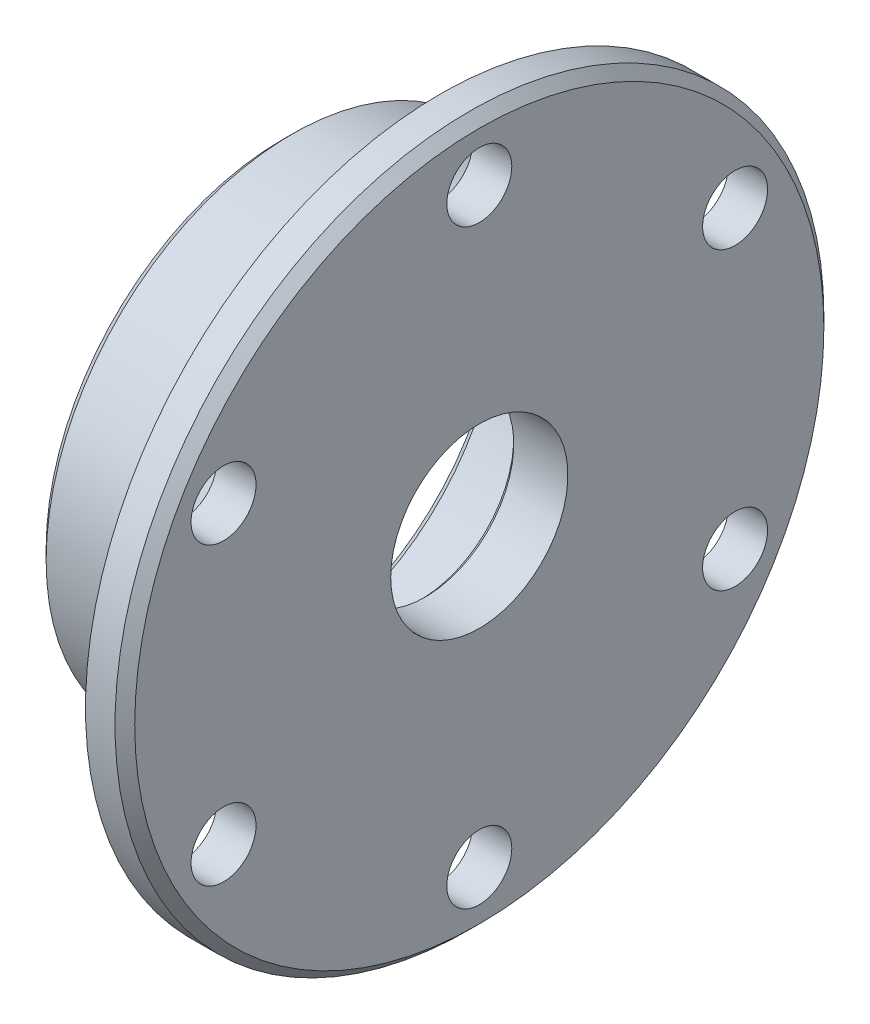
ISO-10303-21;
HEADER;
FILE_DESCRIPTION(('STEP AP214'),'2;1');
FILE_NAME('part.step','',(''),(''),'','','');
FILE_SCHEMA(('AUTOMOTIVE_DESIGN { 1 0 10303 214 1 1 1 1 }'));
ENDSEC;
DATA;
#1=APPLICATION_CONTEXT('core data for automotive mechanical design processes');
#2=APPLICATION_PROTOCOL_DEFINITION('international standard','automotive_design',2000,#1);
#3=PRODUCT_CONTEXT('',#1,'mechanical');
#4=PRODUCT('Part','Part','',(#3));
#5=PRODUCT_RELATED_PRODUCT_CATEGORY('part','',(#4));
#6=PRODUCT_DEFINITION_FORMATION('','',#4);
#7=PRODUCT_DEFINITION_CONTEXT('part definition',#1,'design');
#8=PRODUCT_DEFINITION('design','',#6,#7);
#9=PRODUCT_DEFINITION_SHAPE('','',#8);
#10=(LENGTH_UNIT() NAMED_UNIT(*) SI_UNIT(.MILLI.,.METRE.));
#11=(NAMED_UNIT(*) PLANE_ANGLE_UNIT() SI_UNIT($,.RADIAN.));
#12=(NAMED_UNIT(*) SI_UNIT($,.STERADIAN.) SOLID_ANGLE_UNIT());
#13=UNCERTAINTY_MEASURE_WITH_UNIT(LENGTH_MEASURE(1.E-05),#10,'distance_accuracy_value','');
#14=(GEOMETRIC_REPRESENTATION_CONTEXT(3) GLOBAL_UNCERTAINTY_ASSIGNED_CONTEXT((#13)) GLOBAL_UNIT_ASSIGNED_CONTEXT((#10,
#11,#12)) REPRESENTATION_CONTEXT('',''));
#15=CARTESIAN_POINT('',(0.,0.,0.));
#16=DIRECTION('',(0.,0.,1.));
#17=DIRECTION('',(1.,0.,0.));
#18=AXIS2_PLACEMENT_3D('',#15,#16,#17);
#19=CARTESIAN_POINT('',(-6.,19.,0.));
#20=DIRECTION('',(-1.,0.,0.));
#21=DIRECTION('',(0.,0.,1.));
#22=AXIS2_PLACEMENT_3D('',#19,#20,#21);
#23=PLANE('',#22);
#24=CARTESIAN_POINT('',(-6.,0.,0.));
#25=DIRECTION('',(-1.,0.,0.));
#26=DIRECTION('',(0.,0.,1.));
#27=AXIS2_PLACEMENT_3D('',#24,#25,#26);
#28=CIRCLE('',#27,9.49999999999998);
#29=CARTESIAN_POINT('',(-6.,0.,9.49999999999998));
#30=VERTEX_POINT('',#29);
#31=EDGE_CURVE('E51',#30,#30,#28,.F.);
#32=ORIENTED_EDGE('',*,*,#31,.T.);
#33=EDGE_LOOP('',(#32));
#34=FACE_BOUND('',#33,.T.);
#35=CARTESIAN_POINT('',(-6.,0.,0.));
#36=DIRECTION('',(-1.,0.,0.));
#37=DIRECTION('',(0.,0.,1.));
#38=AXIS2_PLACEMENT_3D('',#35,#36,#37);
#39=CIRCLE('',#38,18.5);
#40=CARTESIAN_POINT('',(-6.,0.,18.5));
#41=VERTEX_POINT('',#40);
#42=EDGE_CURVE('E68',#41,#41,#39,.T.);
#43=ORIENTED_EDGE('',*,*,#42,.T.);
#44=EDGE_LOOP('',(#43));
#45=FACE_BOUND('',#44,.T.);
#46=ADVANCED_FACE('F36',(#34,#45),#23,.T.);
#47=CARTESIAN_POINT('',(0.,0.,0.));
#48=DIRECTION('',(1.,0.,0.));
#49=DIRECTION('',(0.,0.,-1.));
#50=AXIS2_PLACEMENT_3D('',#47,#48,#49);
#51=CYLINDRICAL_SURFACE('',#50,19.);
#52=CARTESIAN_POINT('',(-6.5,0.,0.));
#53=DIRECTION('',(-1.,0.,0.));
#54=DIRECTION('',(0.,0.,1.));
#55=AXIS2_PLACEMENT_3D('',#52,#53,#54);
#56=CIRCLE('',#55,19.);
#57=CARTESIAN_POINT('',(-6.5,0.,19.));
#58=VERTEX_POINT('',#57);
#59=EDGE_CURVE('E71',#58,#58,#56,.F.);
#60=ORIENTED_EDGE('',*,*,#59,.T.);
#61=EDGE_LOOP('',(#60));
#62=FACE_BOUND('',#61,.T.);
#63=CARTESIAN_POINT('',(-8.,0.,0.));
#64=DIRECTION('',(1.,0.,0.));
#65=DIRECTION('',(0.,0.,-1.));
#66=AXIS2_PLACEMENT_3D('',#63,#64,#65);
#67=CIRCLE('',#66,19.);
#68=CARTESIAN_POINT('',(-8.,0.,-19.));
#69=VERTEX_POINT('',#68);
#70=EDGE_CURVE('E86',#69,#69,#67,.T.);
#71=ORIENTED_EDGE('',*,*,#70,.F.);
#72=EDGE_LOOP('',(#71));
#73=FACE_BOUND('',#72,.T.);
#74=ADVANCED_FACE('F164',(#62,#73),#51,.F.);
#75=CARTESIAN_POINT('',(-8.,21.,0.));
#76=DIRECTION('',(-1.,0.,0.));
#77=DIRECTION('',(0.,0.,1.));
#78=AXIS2_PLACEMENT_3D('',#75,#76,#77);
#79=PLANE('',#78);
#80=CARTESIAN_POINT('',(-8.,0.,0.));
#81=DIRECTION('',(-1.,0.,0.));
#82=DIRECTION('',(0.,0.,1.));
#83=AXIS2_PLACEMENT_3D('',#80,#81,#82);
#84=CIRCLE('',#83,20.5);
#85=CARTESIAN_POINT('',(-8.,0.,20.5));
#86=VERTEX_POINT('',#85);
#87=EDGE_CURVE('E62',#86,#86,#84,.T.);
#88=ORIENTED_EDGE('',*,*,#87,.T.);
#89=EDGE_LOOP('',(#88));
#90=FACE_BOUND('',#89,.T.);
#91=ORIENTED_EDGE('',*,*,#70,.T.);
#92=EDGE_LOOP('',(#91));
#93=FACE_BOUND('',#92,.T.);
#94=ADVANCED_FACE('F170',(#90,#93),#79,.T.);
#95=CARTESIAN_POINT('',(0.,0.,0.));
#96=DIRECTION('',(1.,0.,0.));
#97=DIRECTION('',(0.,0.,-1.));
#98=AXIS2_PLACEMENT_3D('',#95,#96,#97);
#99=CYLINDRICAL_SURFACE('',#98,21.);
#100=CARTESIAN_POINT('',(-8.5,0.,0.));
#101=DIRECTION('',(-1.,0.,0.));
#102=DIRECTION('',(0.,0.,1.));
#103=AXIS2_PLACEMENT_3D('',#100,#101,#102);
#104=CIRCLE('',#103,21.);
#105=CARTESIAN_POINT('',(-8.5,0.,21.));
#106=VERTEX_POINT('',#105);
#107=EDGE_CURVE('E65',#106,#106,#104,.F.);
#108=ORIENTED_EDGE('',*,*,#107,.T.);
#109=EDGE_LOOP('',(#108));
#110=FACE_BOUND('',#109,.T.);
#111=CARTESIAN_POINT('',(-19.,0.,0.));
#112=DIRECTION('',(-1.,0.,0.));
#113=DIRECTION('',(0.,0.,1.));
#114=AXIS2_PLACEMENT_3D('',#111,#112,#113);
#115=CIRCLE('',#114,21.);
#116=CARTESIAN_POINT('',(-19.,0.,21.));
#117=VERTEX_POINT('',#116);
#118=EDGE_CURVE('E74',#117,#117,#115,.T.);
#119=ORIENTED_EDGE('',*,*,#118,.T.);
#120=EDGE_LOOP('',(#119));
#121=FACE_BOUND('',#120,.T.);
#122=ADVANCED_FACE('F262',(#110,#121),#99,.F.);
#123=CARTESIAN_POINT('',(-20.,25.,0.));
#124=DIRECTION('',(-1.,0.,0.));
#125=DIRECTION('',(0.,0.,1.));
#126=AXIS2_PLACEMENT_3D('',#123,#124,#125);
#127=PLANE('',#126);
#128=CARTESIAN_POINT('',(-20.,0.,0.));
#129=DIRECTION('',(-1.,0.,0.));
#130=DIRECTION('',(0.,0.,1.));
#131=AXIS2_PLACEMENT_3D('',#128,#129,#130);
#132=CIRCLE('',#131,24.);
#133=CARTESIAN_POINT('',(-20.,0.,24.));
#134=VERTEX_POINT('',#133);
#135=EDGE_CURVE('E77',#134,#134,#132,.T.);
#136=ORIENTED_EDGE('',*,*,#135,.T.);
#137=EDGE_LOOP('',(#136));
#138=FACE_BOUND('',#137,.T.);
#139=CARTESIAN_POINT('',(-20.,0.,0.));
#140=DIRECTION('',(-1.,0.,0.));
#141=DIRECTION('',(0.,0.,1.));
#142=AXIS2_PLACEMENT_3D('',#139,#140,#141);
#143=CIRCLE('',#142,22.);
#144=CARTESIAN_POINT('',(-20.,0.,22.));
#145=VERTEX_POINT('',#144);
#146=EDGE_CURVE('E80',#145,#145,#143,.F.);
#147=ORIENTED_EDGE('',*,*,#146,.T.);
#148=EDGE_LOOP('',(#147));
#149=FACE_BOUND('',#148,.T.);
#150=ADVANCED_FACE('F258',(#138,#149),#127,.T.);
#151=CARTESIAN_POINT('',(0.,0.,0.));
#152=DIRECTION('',(1.,0.,0.));
#153=DIRECTION('',(0.,0.,-1.));
#154=AXIS2_PLACEMENT_3D('',#151,#152,#153);
#155=CYLINDRICAL_SURFACE('',#154,25.);
#156=CARTESIAN_POINT('',(-4.5,0.,0.));
#157=DIRECTION('',(-1.,0.,0.));
#158=DIRECTION('',(0.,0.,1.));
#159=AXIS2_PLACEMENT_3D('',#156,#157,#158);
#160=CIRCLE('',#159,25.);
#161=CARTESIAN_POINT('',(-4.5,0.,25.));
#162=VERTEX_POINT('',#161);
#163=EDGE_CURVE('E56',#162,#162,#160,.T.);
#164=ORIENTED_EDGE('',*,*,#163,.T.);
#165=EDGE_LOOP('',(#164));
#166=FACE_BOUND('',#165,.T.);
#167=CARTESIAN_POINT('',(-19.,0.,0.));
#168=DIRECTION('',(-1.,0.,0.));
#169=DIRECTION('',(0.,0.,1.));
#170=AXIS2_PLACEMENT_3D('',#167,#168,#169);
#171=CIRCLE('',#170,25.);
#172=CARTESIAN_POINT('',(-19.,0.,25.));
#173=VERTEX_POINT('',#172);
#174=EDGE_CURVE('E83',#173,#173,#171,.F.);
#175=ORIENTED_EDGE('',*,*,#174,.T.);
#176=EDGE_LOOP('',(#175));
#177=FACE_BOUND('',#176,.T.);
#178=ADVANCED_FACE('F235',(#166,#177),#155,.T.);
#179=CARTESIAN_POINT('',(-4.,36.,0.));
#180=DIRECTION('',(-1.,0.,0.));
#181=DIRECTION('',(0.,0.,1.));
#182=AXIS2_PLACEMENT_3D('',#179,#180,#181);
#183=PLANE('',#182);
#184=CARTESIAN_POINT('',(-4.,-15.0000000000003,25.980762113533));
#185=DIRECTION('',(-1.,0.,0.));
#186=DIRECTION('',(0.,0.,1.));
#187=AXIS2_PLACEMENT_3D('',#184,#185,#186);
#188=CIRCLE('',#187,3.29999999999999);
#189=CARTESIAN_POINT('',(-4.,-15.0000000000003,29.280762113533));
#190=VERTEX_POINT('',#189);
#191=EDGE_CURVE('E125',#190,#190,#188,.T.);
#192=ORIENTED_EDGE('',*,*,#191,.F.);
#193=EDGE_LOOP('',(#192));
#194=FACE_BOUND('',#193,.T.);
#195=CARTESIAN_POINT('',(-4.,14.9999999999998,25.9807621135333));
#196=DIRECTION('',(-1.,0.,0.));
#197=DIRECTION('',(0.,0.,1.));
#198=AXIS2_PLACEMENT_3D('',#195,#196,#197);
#199=CIRCLE('',#198,3.29999999999999);
#200=CARTESIAN_POINT('',(-4.,14.9999999999998,29.2807621135333));
#201=VERTEX_POINT('',#200);
#202=EDGE_CURVE('E119',#201,#201,#199,.T.);
#203=ORIENTED_EDGE('',*,*,#202,.F.);
#204=EDGE_LOOP('',(#203));
#205=FACE_BOUND('',#204,.T.);
#206=CARTESIAN_POINT('',(-4.,30.,0.));
#207=DIRECTION('',(-1.,0.,0.));
#208=DIRECTION('',(0.,0.,1.));
#209=AXIS2_PLACEMENT_3D('',#206,#207,#208);
#210=CIRCLE('',#209,3.29999999999999);
#211=CARTESIAN_POINT('',(-4.,30.,3.29999999999999));
#212=VERTEX_POINT('',#211);
#213=EDGE_CURVE('E113',#212,#212,#210,.T.);
#214=ORIENTED_EDGE('',*,*,#213,.F.);
#215=EDGE_LOOP('',(#214));
#216=FACE_BOUND('',#215,.T.);
#217=CARTESIAN_POINT('',(-4.,15.0000000000001,-25.9807621135331));
#218=DIRECTION('',(-1.,0.,0.));
#219=DIRECTION('',(0.,0.,1.));
#220=AXIS2_PLACEMENT_3D('',#217,#218,#219);
#221=CIRCLE('',#220,3.29999999999999);
#222=CARTESIAN_POINT('',(-4.,15.0000000000001,-22.6807621135331));
#223=VERTEX_POINT('',#222);
#224=EDGE_CURVE('E107',#223,#223,#221,.T.);
#225=ORIENTED_EDGE('',*,*,#224,.F.);
#226=EDGE_LOOP('',(#225));
#227=FACE_BOUND('',#226,.T.);
#228=CARTESIAN_POINT('',(-4.,-14.9999999999999,-25.9807621135332));
#229=DIRECTION('',(-1.,0.,0.));
#230=DIRECTION('',(0.,0.,1.));
#231=AXIS2_PLACEMENT_3D('',#228,#229,#230);
#232=CIRCLE('',#231,3.29999999999999);
#233=CARTESIAN_POINT('',(-4.,-14.9999999999999,-22.6807621135332));
#234=VERTEX_POINT('',#233);
#235=EDGE_CURVE('E101',#234,#234,#232,.T.);
#236=ORIENTED_EDGE('',*,*,#235,.F.);
#237=EDGE_LOOP('',(#236));
#238=FACE_BOUND('',#237,.T.);
#239=CARTESIAN_POINT('',(-4.,-30.,0.));
#240=DIRECTION('',(-1.,0.,0.));
#241=DIRECTION('',(0.,0.,1.));
#242=AXIS2_PLACEMENT_3D('',#239,#240,#241);
#243=CIRCLE('',#242,3.29999999999999);
#244=CARTESIAN_POINT('',(-4.,-30.,3.29999999999999));
#245=VERTEX_POINT('',#244);
#246=EDGE_CURVE('E95',#245,#245,#243,.T.);
#247=ORIENTED_EDGE('',*,*,#246,.F.);
#248=EDGE_LOOP('',(#247));
#249=FACE_BOUND('',#248,.T.);
#250=CARTESIAN_POINT('',(-4.,0.,0.));
#251=DIRECTION('',(-1.,0.,0.));
#252=DIRECTION('',(0.,0.,1.));
#253=AXIS2_PLACEMENT_3D('',#250,#251,#252);
#254=CIRCLE('',#253,25.5);
#255=CARTESIAN_POINT('',(-4.,0.,25.5));
#256=VERTEX_POINT('',#255);
#257=EDGE_CURVE('E59',#256,#256,#254,.F.);
#258=ORIENTED_EDGE('',*,*,#257,.T.);
#259=EDGE_LOOP('',(#258));
#260=FACE_BOUND('',#259,.T.);
#261=CARTESIAN_POINT('',(-4.,0.,0.));
#262=DIRECTION('',(1.,0.,0.));
#263=DIRECTION('',(0.,0.,-1.));
#264=AXIS2_PLACEMENT_3D('',#261,#262,#263);
#265=CIRCLE('',#264,36.);
#266=CARTESIAN_POINT('',(-4.,0.,-36.));
#267=VERTEX_POINT('',#266);
#268=EDGE_CURVE('E89',#267,#267,#265,.T.);
#269=ORIENTED_EDGE('',*,*,#268,.F.);
#270=EDGE_LOOP('',(#269));
#271=FACE_BOUND('',#270,.T.);
#272=ADVANCED_FACE('F232',(#194,#205,#216,#227,#238,#249,#260,#271),#183,.T.);
#273=CARTESIAN_POINT('',(0.,0.,0.));
#274=DIRECTION('',(1.,0.,0.));
#275=DIRECTION('',(0.,0.,-1.));
#276=AXIS2_PLACEMENT_3D('',#273,#274,#275);
#277=CYLINDRICAL_SURFACE('',#276,36.);
#278=CARTESIAN_POINT('',(-1.00000000000002,0.,0.));
#279=DIRECTION('',(1.,0.,0.));
#280=DIRECTION('',(0.,0.,-1.));
#281=AXIS2_PLACEMENT_3D('',#278,#279,#280);
#282=CIRCLE('',#281,36.);
#283=CARTESIAN_POINT('',(-1.00000000000002,0.,-36.));
#284=VERTEX_POINT('',#283);
#285=EDGE_CURVE('E10',#284,#284,#282,.F.);
#286=ORIENTED_EDGE('',*,*,#285,.T.);
#287=EDGE_LOOP('',(#286));
#288=FACE_BOUND('',#287,.T.);
#289=ORIENTED_EDGE('',*,*,#268,.T.);
#290=EDGE_LOOP('',(#289));
#291=FACE_BOUND('',#290,.T.);
#292=ADVANCED_FACE('F138',(#288,#291),#277,.T.);
#293=CARTESIAN_POINT('',(0.,36.,0.));
#294=DIRECTION('',(1.,0.,0.));
#295=DIRECTION('',(0.,0.,-1.));
#296=AXIS2_PLACEMENT_3D('',#293,#294,#295);
#297=PLANE('',#296);
#298=CARTESIAN_POINT('',(0.,-15.0000000000003,25.980762113533));
#299=DIRECTION('',(1.,0.,0.));
#300=DIRECTION('',(0.,0.,-1.));
#301=AXIS2_PLACEMENT_3D('',#298,#299,#300);
#302=CIRCLE('',#301,3.29999999999999);
#303=CARTESIAN_POINT('',(0.,-15.0000000000003,22.680762113533));
#304=VERTEX_POINT('',#303);
#305=EDGE_CURVE('E128',#304,#304,#302,.T.);
#306=ORIENTED_EDGE('',*,*,#305,.F.);
#307=EDGE_LOOP('',(#306));
#308=FACE_BOUND('',#307,.T.);
#309=CARTESIAN_POINT('',(0.,14.9999999999998,25.9807621135333));
#310=DIRECTION('',(1.,0.,0.));
#311=DIRECTION('',(0.,0.,-1.));
#312=AXIS2_PLACEMENT_3D('',#309,#310,#311);
#313=CIRCLE('',#312,3.29999999999999);
#314=CARTESIAN_POINT('',(0.,14.9999999999998,22.6807621135333));
#315=VERTEX_POINT('',#314);
#316=EDGE_CURVE('E122',#315,#315,#313,.T.);
#317=ORIENTED_EDGE('',*,*,#316,.F.);
#318=EDGE_LOOP('',(#317));
#319=FACE_BOUND('',#318,.T.);
#320=CARTESIAN_POINT('',(0.,30.,0.));
#321=DIRECTION('',(1.,0.,0.));
#322=DIRECTION('',(0.,0.,-1.));
#323=AXIS2_PLACEMENT_3D('',#320,#321,#322);
#324=CIRCLE('',#323,3.29999999999999);
#325=CARTESIAN_POINT('',(0.,30.,-3.29999999999999));
#326=VERTEX_POINT('',#325);
#327=EDGE_CURVE('E116',#326,#326,#324,.T.);
#328=ORIENTED_EDGE('',*,*,#327,.F.);
#329=EDGE_LOOP('',(#328));
#330=FACE_BOUND('',#329,.T.);
#331=CARTESIAN_POINT('',(0.,15.0000000000001,-25.9807621135331));
#332=DIRECTION('',(1.,0.,0.));
#333=DIRECTION('',(0.,0.,-1.));
#334=AXIS2_PLACEMENT_3D('',#331,#332,#333);
#335=CIRCLE('',#334,3.29999999999999);
#336=CARTESIAN_POINT('',(0.,15.0000000000001,-29.2807621135331));
#337=VERTEX_POINT('',#336);
#338=EDGE_CURVE('E110',#337,#337,#335,.T.);
#339=ORIENTED_EDGE('',*,*,#338,.F.);
#340=EDGE_LOOP('',(#339));
#341=FACE_BOUND('',#340,.T.);
#342=CARTESIAN_POINT('',(0.,-14.9999999999999,-25.9807621135332));
#343=DIRECTION('',(1.,0.,0.));
#344=DIRECTION('',(0.,0.,-1.));
#345=AXIS2_PLACEMENT_3D('',#342,#343,#344);
#346=CIRCLE('',#345,3.29999999999999);
#347=CARTESIAN_POINT('',(0.,-14.9999999999999,-29.2807621135332));
#348=VERTEX_POINT('',#347);
#349=EDGE_CURVE('E104',#348,#348,#346,.T.);
#350=ORIENTED_EDGE('',*,*,#349,.F.);
#351=EDGE_LOOP('',(#350));
#352=FACE_BOUND('',#351,.T.);
#353=CARTESIAN_POINT('',(0.,-30.,0.));
#354=DIRECTION('',(1.,0.,0.));
#355=DIRECTION('',(0.,0.,-1.));
#356=AXIS2_PLACEMENT_3D('',#353,#354,#355);
#357=CIRCLE('',#356,3.29999999999999);
#358=CARTESIAN_POINT('',(0.,-30.,-3.29999999999999));
#359=VERTEX_POINT('',#358);
#360=EDGE_CURVE('E98',#359,#359,#357,.T.);
#361=ORIENTED_EDGE('',*,*,#360,.F.);
#362=EDGE_LOOP('',(#361));
#363=FACE_BOUND('',#362,.T.);
#364=CARTESIAN_POINT('',(0.,0.,0.));
#365=DIRECTION('',(1.,0.,0.));
#366=DIRECTION('',(0.,0.,-1.));
#367=AXIS2_PLACEMENT_3D('',#364,#365,#366);
#368=CIRCLE('',#367,35.);
#369=CARTESIAN_POINT('',(0.,0.,-35.));
#370=VERTEX_POINT('',#369);
#371=EDGE_CURVE('E43',#370,#370,#368,.T.);
#372=ORIENTED_EDGE('',*,*,#371,.T.);
#373=EDGE_LOOP('',(#372));
#374=FACE_BOUND('',#373,.T.);
#375=CARTESIAN_POINT('',(0.,0.,0.));
#376=DIRECTION('',(-1.,0.,0.));
#377=DIRECTION('',(0.,0.,1.));
#378=AXIS2_PLACEMENT_3D('',#375,#376,#377);
#379=CIRCLE('',#378,9.);
#380=CARTESIAN_POINT('',(0.,0.,9.));
#381=VERTEX_POINT('',#380);
#382=EDGE_CURVE('E92',#381,#381,#379,.T.);
#383=ORIENTED_EDGE('',*,*,#382,.T.);
#384=EDGE_LOOP('',(#383));
#385=FACE_BOUND('',#384,.T.);
#386=ADVANCED_FACE('F134',(#308,#319,#330,#341,#352,#363,#374,#385),#297,.T.);
#387=CARTESIAN_POINT('',(0.,0.,0.));
#388=DIRECTION('',(-1.,0.,0.));
#389=DIRECTION('',(0.,0.,1.));
#390=AXIS2_PLACEMENT_3D('',#387,#388,#389);
#391=CYLINDRICAL_SURFACE('',#390,9.);
#392=CARTESIAN_POINT('',(-5.50000000000001,0.,0.));
#393=DIRECTION('',(-1.,0.,0.));
#394=DIRECTION('',(0.,0.,1.));
#395=AXIS2_PLACEMENT_3D('',#392,#393,#394);
#396=CIRCLE('',#395,9.);
#397=CARTESIAN_POINT('',(-5.50000000000001,0.,9.));
#398=VERTEX_POINT('',#397);
#399=EDGE_CURVE('E47',#398,#398,#396,.T.);
#400=ORIENTED_EDGE('',*,*,#399,.T.);
#401=EDGE_LOOP('',(#400));
#402=FACE_BOUND('',#401,.T.);
#403=ORIENTED_EDGE('',*,*,#382,.F.);
#404=EDGE_LOOP('',(#403));
#405=FACE_BOUND('',#404,.T.);
#406=ADVANCED_FACE('F137',(#402,#405),#391,.F.);
#407=CARTESIAN_POINT('',(-19.,0.,0.));
#408=DIRECTION('',(1.,0.,0.));
#409=DIRECTION('',(0.,0.,-1.));
#410=AXIS2_PLACEMENT_3D('',#407,#408,#409);
#411=CONICAL_SURFACE('',#410,25.,0.785398163397448);
#412=ORIENTED_EDGE('',*,*,#135,.F.);
#413=EDGE_LOOP('',(#412));
#414=FACE_BOUND('',#413,.T.);
#415=ORIENTED_EDGE('',*,*,#174,.F.);
#416=EDGE_LOOP('',(#415));
#417=FACE_BOUND('',#416,.T.);
#418=ADVANCED_FACE('F153',(#414,#417),#411,.T.);
#419=CARTESIAN_POINT('',(-20.,0.,0.));
#420=DIRECTION('',(-1.,0.,0.));
#421=DIRECTION('',(0.,0.,1.));
#422=AXIS2_PLACEMENT_3D('',#419,#420,#421);
#423=CONICAL_SURFACE('',#422,22.,0.785398163397443);
#424=ORIENTED_EDGE('',*,*,#118,.F.);
#425=EDGE_LOOP('',(#424));
#426=FACE_BOUND('',#425,.T.);
#427=ORIENTED_EDGE('',*,*,#146,.F.);
#428=EDGE_LOOP('',(#427));
#429=FACE_BOUND('',#428,.T.);
#430=ADVANCED_FACE('F159',(#426,#429),#423,.F.);
#431=CARTESIAN_POINT('',(-6.5,0.,0.));
#432=DIRECTION('',(-1.,0.,0.));
#433=DIRECTION('',(0.,0.,1.));
#434=AXIS2_PLACEMENT_3D('',#431,#432,#433);
#435=TOROIDAL_SURFACE('',#434,18.5,0.5);
#436=ORIENTED_EDGE('',*,*,#42,.F.);
#437=EDGE_LOOP('',(#436));
#438=FACE_BOUND('',#437,.T.);
#439=ORIENTED_EDGE('',*,*,#59,.F.);
#440=EDGE_LOOP('',(#439));
#441=FACE_BOUND('',#440,.T.);
#442=ADVANCED_FACE('F178',(#438,#441),#435,.F.);
#443=CARTESIAN_POINT('',(-8.5,0.,0.));
#444=DIRECTION('',(-1.,0.,0.));
#445=DIRECTION('',(0.,0.,1.));
#446=AXIS2_PLACEMENT_3D('',#443,#444,#445);
#447=TOROIDAL_SURFACE('',#446,20.5,0.5);
#448=ORIENTED_EDGE('',*,*,#87,.F.);
#449=EDGE_LOOP('',(#448));
#450=FACE_BOUND('',#449,.T.);
#451=ORIENTED_EDGE('',*,*,#107,.F.);
#452=EDGE_LOOP('',(#451));
#453=FACE_BOUND('',#452,.T.);
#454=ADVANCED_FACE('F182',(#450,#453),#447,.F.);
#455=CARTESIAN_POINT('',(-4.5,0.,0.));
#456=DIRECTION('',(-1.,0.,0.));
#457=DIRECTION('',(0.,0.,1.));
#458=AXIS2_PLACEMENT_3D('',#455,#456,#457);
#459=TOROIDAL_SURFACE('',#458,25.5,0.5);
#460=ORIENTED_EDGE('',*,*,#163,.F.);
#461=EDGE_LOOP('',(#460));
#462=FACE_BOUND('',#461,.T.);
#463=ORIENTED_EDGE('',*,*,#257,.F.);
#464=EDGE_LOOP('',(#463));
#465=FACE_BOUND('',#464,.T.);
#466=ADVANCED_FACE('F186',(#462,#465),#459,.F.);
#467=CARTESIAN_POINT('',(-6.,0.,0.));
#468=DIRECTION('',(-1.,0.,0.));
#469=DIRECTION('',(0.,0.,1.));
#470=AXIS2_PLACEMENT_3D('',#467,#468,#469);
#471=CONICAL_SURFACE('',#470,9.49999999999998,0.785398163397438);
#472=ORIENTED_EDGE('',*,*,#399,.F.);
#473=EDGE_LOOP('',(#472));
#474=FACE_BOUND('',#473,.T.);
#475=ORIENTED_EDGE('',*,*,#31,.F.);
#476=EDGE_LOOP('',(#475));
#477=FACE_BOUND('',#476,.T.);
#478=ADVANCED_FACE('F189',(#474,#477),#471,.F.);
#479=CARTESIAN_POINT('',(0.,0.,0.));
#480=DIRECTION('',(-1.,0.,0.));
#481=DIRECTION('',(0.,0.,1.));
#482=AXIS2_PLACEMENT_3D('',#479,#480,#481);
#483=CONICAL_SURFACE('',#482,35.,0.785398163397441);
#484=ORIENTED_EDGE('',*,*,#285,.F.);
#485=EDGE_LOOP('',(#484));
#486=FACE_BOUND('',#485,.T.);
#487=ORIENTED_EDGE('',*,*,#371,.F.);
#488=EDGE_LOOP('',(#487));
#489=FACE_BOUND('',#488,.T.);
#490=ADVANCED_FACE('F38',(#486,#489),#483,.T.);
#491=CARTESIAN_POINT('',(0.,-30.,0.));
#492=DIRECTION('',(1.,0.,0.));
#493=DIRECTION('',(0.,0.,-1.));
#494=AXIS2_PLACEMENT_3D('',#491,#492,#493);
#495=CYLINDRICAL_SURFACE('',#494,3.29999999999999);
#496=ORIENTED_EDGE('',*,*,#246,.T.);
#497=EDGE_LOOP('',(#496));
#498=FACE_BOUND('',#497,.T.);
#499=ORIENTED_EDGE('',*,*,#360,.T.);
#500=EDGE_LOOP('',(#499));
#501=FACE_BOUND('',#500,.T.);
#502=ADVANCED_FACE('F196',(#498,#501),#495,.F.);
#503=CARTESIAN_POINT('',(0.,-14.9999999999999,-25.9807621135332));
#504=DIRECTION('',(1.,0.,0.));
#505=DIRECTION('',(0.,0.,-1.));
#506=AXIS2_PLACEMENT_3D('',#503,#504,#505);
#507=CYLINDRICAL_SURFACE('',#506,3.29999999999999);
#508=ORIENTED_EDGE('',*,*,#235,.T.);
#509=EDGE_LOOP('',(#508));
#510=FACE_BOUND('',#509,.T.);
#511=ORIENTED_EDGE('',*,*,#349,.T.);
#512=EDGE_LOOP('',(#511));
#513=FACE_BOUND('',#512,.T.);
#514=ADVANCED_FACE('F204',(#510,#513),#507,.F.);
#515=CARTESIAN_POINT('',(0.,15.0000000000001,-25.9807621135331));
#516=DIRECTION('',(1.,0.,0.));
#517=DIRECTION('',(0.,0.,-1.));
#518=AXIS2_PLACEMENT_3D('',#515,#516,#517);
#519=CYLINDRICAL_SURFACE('',#518,3.29999999999999);
#520=ORIENTED_EDGE('',*,*,#224,.T.);
#521=EDGE_LOOP('',(#520));
#522=FACE_BOUND('',#521,.T.);
#523=ORIENTED_EDGE('',*,*,#338,.T.);
#524=EDGE_LOOP('',(#523));
#525=FACE_BOUND('',#524,.T.);
#526=ADVANCED_FACE('F210',(#522,#525),#519,.F.);
#527=CARTESIAN_POINT('',(0.,30.,0.));
#528=DIRECTION('',(1.,0.,0.));
#529=DIRECTION('',(0.,0.,-1.));
#530=AXIS2_PLACEMENT_3D('',#527,#528,#529);
#531=CYLINDRICAL_SURFACE('',#530,3.29999999999999);
#532=ORIENTED_EDGE('',*,*,#213,.T.);
#533=EDGE_LOOP('',(#532));
#534=FACE_BOUND('',#533,.T.);
#535=ORIENTED_EDGE('',*,*,#327,.T.);
#536=EDGE_LOOP('',(#535));
#537=FACE_BOUND('',#536,.T.);
#538=ADVANCED_FACE('F217',(#534,#537),#531,.F.);
#539=CARTESIAN_POINT('',(0.,14.9999999999998,25.9807621135333));
#540=DIRECTION('',(1.,0.,0.));
#541=DIRECTION('',(0.,0.,-1.));
#542=AXIS2_PLACEMENT_3D('',#539,#540,#541);
#543=CYLINDRICAL_SURFACE('',#542,3.29999999999999);
#544=ORIENTED_EDGE('',*,*,#202,.T.);
#545=EDGE_LOOP('',(#544));
#546=FACE_BOUND('',#545,.T.);
#547=ORIENTED_EDGE('',*,*,#316,.T.);
#548=EDGE_LOOP('',(#547));
#549=FACE_BOUND('',#548,.T.);
#550=ADVANCED_FACE('F221',(#546,#549),#543,.F.);
#551=CARTESIAN_POINT('',(0.,-15.0000000000003,25.980762113533));
#552=DIRECTION('',(1.,0.,0.));
#553=DIRECTION('',(0.,0.,-1.));
#554=AXIS2_PLACEMENT_3D('',#551,#552,#553);
#555=CYLINDRICAL_SURFACE('',#554,3.29999999999999);
#556=ORIENTED_EDGE('',*,*,#191,.T.);
#557=EDGE_LOOP('',(#556));
#558=FACE_BOUND('',#557,.T.);
#559=ORIENTED_EDGE('',*,*,#305,.T.);
#560=EDGE_LOOP('',(#559));
#561=FACE_BOUND('',#560,.T.);
#562=ADVANCED_FACE('F132',(#558,#561),#555,.F.);
#563=CLOSED_SHELL('',(#46,#74,#94,#122,#150,#178,#272,#292,#386,#406,#418,#430,#442,#454,#466,
#478,#490,#502,#514,#526,#538,#550,#562));
#564=MANIFOLD_SOLID_BREP('B2',#563);
#565=ADVANCED_BREP_SHAPE_REPRESENTATION('',(#18,#564),#14);
#566=SHAPE_DEFINITION_REPRESENTATION(#9,#565);
ENDSEC;
END-ISO-10303-21;
